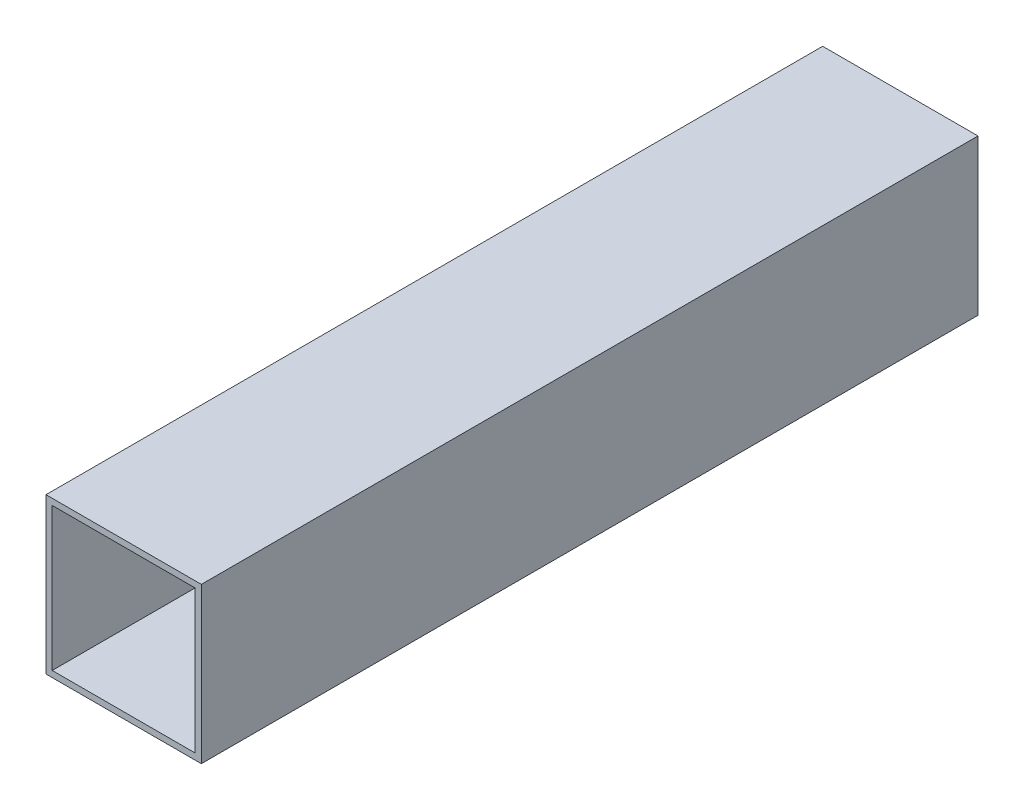
ISO-10303-21;
HEADER;
FILE_DESCRIPTION(('STEP AP214'),'2;1');
FILE_NAME('part.step','',(''),(''),'','','');
FILE_SCHEMA(('AUTOMOTIVE_DESIGN { 1 0 10303 214 1 1 1 1 }'));
ENDSEC;
DATA;
#1=APPLICATION_CONTEXT('core data for automotive mechanical design processes');
#2=APPLICATION_PROTOCOL_DEFINITION('international standard','automotive_design',2000,#1);
#3=PRODUCT_CONTEXT('',#1,'mechanical');
#4=PRODUCT('Part','Part','',(#3));
#5=PRODUCT_RELATED_PRODUCT_CATEGORY('part','',(#4));
#6=PRODUCT_DEFINITION_FORMATION('','',#4);
#7=PRODUCT_DEFINITION_CONTEXT('part definition',#1,'design');
#8=PRODUCT_DEFINITION('design','',#6,#7);
#9=PRODUCT_DEFINITION_SHAPE('','',#8);
#10=(LENGTH_UNIT() NAMED_UNIT(*) SI_UNIT(.MILLI.,.METRE.));
#11=(NAMED_UNIT(*) PLANE_ANGLE_UNIT() SI_UNIT($,.RADIAN.));
#12=(NAMED_UNIT(*) SI_UNIT($,.STERADIAN.) SOLID_ANGLE_UNIT());
#13=UNCERTAINTY_MEASURE_WITH_UNIT(LENGTH_MEASURE(1.E-05),#10,'distance_accuracy_value','');
#14=(GEOMETRIC_REPRESENTATION_CONTEXT(3) GLOBAL_UNCERTAINTY_ASSIGNED_CONTEXT((#13)) GLOBAL_UNIT_ASSIGNED_CONTEXT((#10,
#11,#12)) REPRESENTATION_CONTEXT('',''));
#15=CARTESIAN_POINT('',(0.,0.,0.));
#16=DIRECTION('',(0.,0.,1.));
#17=DIRECTION('',(1.,0.,0.));
#18=AXIS2_PLACEMENT_3D('',#15,#16,#17);
#19=CARTESIAN_POINT('',(0.,0.,200.));
#20=DIRECTION('',(0.,0.,-1.));
#21=DIRECTION('',(-1.,0.,0.));
#22=AXIS2_PLACEMENT_3D('',#19,#20,#21);
#23=PLANE('',#22);
#24=DIRECTION('',(0.,1.,0.));
#25=VECTOR('',#24,1.);
#26=CARTESIAN_POINT('',(20.,-20.,200.));
#27=LINE('',#26,#25);
#28=CARTESIAN_POINT('',(20.,-20.,200.));
#29=VERTEX_POINT('',#28);
#30=CARTESIAN_POINT('',(20.,20.,200.));
#31=VERTEX_POINT('',#30);
#32=EDGE_CURVE('E135',#29,#31,#27,.T.);
#33=ORIENTED_EDGE('',*,*,#32,.T.);
#34=DIRECTION('',(-1.,0.,0.));
#35=VECTOR('',#34,1.);
#36=CARTESIAN_POINT('',(-20.,20.,200.));
#37=LINE('',#36,#35);
#38=CARTESIAN_POINT('',(-20.,20.,200.));
#39=VERTEX_POINT('',#38);
#40=EDGE_CURVE('E138',#31,#39,#37,.T.);
#41=ORIENTED_EDGE('',*,*,#40,.T.);
#42=DIRECTION('',(0.,-1.,0.));
#43=VECTOR('',#42,1.);
#44=CARTESIAN_POINT('',(-20.,-20.,200.));
#45=LINE('',#44,#43);
#46=CARTESIAN_POINT('',(-20.,-20.,200.));
#47=VERTEX_POINT('',#46);
#48=EDGE_CURVE('E141',#39,#47,#45,.T.);
#49=ORIENTED_EDGE('',*,*,#48,.T.);
#50=DIRECTION('',(1.,0.,0.));
#51=VECTOR('',#50,1.);
#52=CARTESIAN_POINT('',(-20.,-20.,200.));
#53=LINE('',#52,#51);
#54=EDGE_CURVE('E143',#47,#29,#53,.T.);
#55=ORIENTED_EDGE('',*,*,#54,.T.);
#56=EDGE_LOOP('',(#33,#41,#49,#55));
#57=FACE_BOUND('',#56,.T.);
#58=DIRECTION('',(0.,1.,0.));
#59=VECTOR('',#58,1.);
#60=CARTESIAN_POINT('',(18.4,-18.4,200.));
#61=LINE('',#60,#59);
#62=CARTESIAN_POINT('',(18.4,-18.4,200.));
#63=VERTEX_POINT('',#62);
#64=CARTESIAN_POINT('',(18.4,18.4,200.));
#65=VERTEX_POINT('',#64);
#66=EDGE_CURVE('E99',#63,#65,#61,.T.);
#67=ORIENTED_EDGE('',*,*,#66,.F.);
#68=DIRECTION('',(1.,0.,0.));
#69=VECTOR('',#68,1.);
#70=CARTESIAN_POINT('',(-18.4,-18.4,200.));
#71=LINE('',#70,#69);
#72=CARTESIAN_POINT('',(-18.4,-18.4,200.));
#73=VERTEX_POINT('',#72);
#74=EDGE_CURVE('E121',#73,#63,#71,.T.);
#75=ORIENTED_EDGE('',*,*,#74,.F.);
#76=DIRECTION('',(0.,-1.,0.));
#77=VECTOR('',#76,1.);
#78=CARTESIAN_POINT('',(-18.4,-18.4,200.));
#79=LINE('',#78,#77);
#80=CARTESIAN_POINT('',(-18.4,18.4,200.));
#81=VERTEX_POINT('',#80);
#82=EDGE_CURVE('E119',#81,#73,#79,.T.);
#83=ORIENTED_EDGE('',*,*,#82,.F.);
#84=DIRECTION('',(-1.,0.,0.));
#85=VECTOR('',#84,1.);
#86=CARTESIAN_POINT('',(-18.4,18.4,200.));
#87=LINE('',#86,#85);
#88=EDGE_CURVE('E107',#65,#81,#87,.T.);
#89=ORIENTED_EDGE('',*,*,#88,.F.);
#90=EDGE_LOOP('',(#67,#75,#83,#89));
#91=FACE_BOUND('',#90,.T.);
#92=ADVANCED_FACE('F34',(#57,#91),#23,.F.);
#93=CARTESIAN_POINT('',(0.,0.,0.));
#94=DIRECTION('',(0.,0.,-1.));
#95=DIRECTION('',(-1.,0.,0.));
#96=AXIS2_PLACEMENT_3D('',#93,#94,#95);
#97=PLANE('',#96);
#98=DIRECTION('',(0.,1.,0.));
#99=VECTOR('',#98,1.);
#100=CARTESIAN_POINT('',(20.,-20.,0.));
#101=LINE('',#100,#99);
#102=CARTESIAN_POINT('',(20.,-20.,0.));
#103=VERTEX_POINT('',#102);
#104=CARTESIAN_POINT('',(20.,20.,0.));
#105=VERTEX_POINT('',#104);
#106=EDGE_CURVE('E115',#103,#105,#101,.T.);
#107=ORIENTED_EDGE('',*,*,#106,.F.);
#108=DIRECTION('',(1.,0.,0.));
#109=VECTOR('',#108,1.);
#110=CARTESIAN_POINT('',(-20.,-20.,0.));
#111=LINE('',#110,#109);
#112=CARTESIAN_POINT('',(-20.,-20.,0.));
#113=VERTEX_POINT('',#112);
#114=EDGE_CURVE('E139',#113,#103,#111,.T.);
#115=ORIENTED_EDGE('',*,*,#114,.F.);
#116=DIRECTION('',(0.,-1.,0.));
#117=VECTOR('',#116,1.);
#118=CARTESIAN_POINT('',(-20.,-20.,0.));
#119=LINE('',#118,#117);
#120=CARTESIAN_POINT('',(-20.,20.,0.));
#121=VERTEX_POINT('',#120);
#122=EDGE_CURVE('E150',#121,#113,#119,.T.);
#123=ORIENTED_EDGE('',*,*,#122,.F.);
#124=DIRECTION('',(-1.,0.,0.));
#125=VECTOR('',#124,1.);
#126=CARTESIAN_POINT('',(-20.,20.,0.));
#127=LINE('',#126,#125);
#128=EDGE_CURVE('E148',#105,#121,#127,.T.);
#129=ORIENTED_EDGE('',*,*,#128,.F.);
#130=EDGE_LOOP('',(#107,#115,#123,#129));
#131=FACE_BOUND('',#130,.T.);
#132=DIRECTION('',(1.,0.,0.));
#133=VECTOR('',#132,1.);
#134=CARTESIAN_POINT('',(-18.4,-18.4,0.));
#135=LINE('',#134,#133);
#136=CARTESIAN_POINT('',(-18.4,-18.4,0.));
#137=VERTEX_POINT('',#136);
#138=CARTESIAN_POINT('',(18.4,-18.4,0.));
#139=VERTEX_POINT('',#138);
#140=EDGE_CURVE('E108',#137,#139,#135,.T.);
#141=ORIENTED_EDGE('',*,*,#140,.T.);
#142=DIRECTION('',(0.,1.,0.));
#143=VECTOR('',#142,1.);
#144=CARTESIAN_POINT('',(18.4,-18.4,0.));
#145=LINE('',#144,#143);
#146=CARTESIAN_POINT('',(18.4,18.4,0.));
#147=VERTEX_POINT('',#146);
#148=EDGE_CURVE('E57',#139,#147,#145,.T.);
#149=ORIENTED_EDGE('',*,*,#148,.T.);
#150=DIRECTION('',(-1.,0.,0.));
#151=VECTOR('',#150,1.);
#152=CARTESIAN_POINT('',(-18.4,18.4,0.));
#153=LINE('',#152,#151);
#154=CARTESIAN_POINT('',(-18.4,18.4,0.));
#155=VERTEX_POINT('',#154);
#156=EDGE_CURVE('E114',#147,#155,#153,.T.);
#157=ORIENTED_EDGE('',*,*,#156,.T.);
#158=DIRECTION('',(0.,-1.,0.));
#159=VECTOR('',#158,1.);
#160=CARTESIAN_POINT('',(-18.4,-18.4,0.));
#161=LINE('',#160,#159);
#162=EDGE_CURVE('E127',#155,#137,#161,.T.);
#163=ORIENTED_EDGE('',*,*,#162,.T.);
#164=EDGE_LOOP('',(#141,#149,#157,#163));
#165=FACE_BOUND('',#164,.T.);
#166=ADVANCED_FACE('F168',(#131,#165),#97,.T.);
#167=CARTESIAN_POINT('',(20.,-20.,200.));
#168=DIRECTION('',(-1.,0.,0.));
#169=DIRECTION('',(0.,0.,1.));
#170=AXIS2_PLACEMENT_3D('',#167,#168,#169);
#171=PLANE('',#170);
#172=ORIENTED_EDGE('',*,*,#106,.T.);
#173=DIRECTION('',(0.,0.,-1.));
#174=VECTOR('',#173,1.);
#175=CARTESIAN_POINT('',(20.,20.,200.));
#176=LINE('',#175,#174);
#177=EDGE_CURVE('E11',#31,#105,#176,.T.);
#178=ORIENTED_EDGE('',*,*,#177,.F.);
#179=ORIENTED_EDGE('',*,*,#32,.F.);
#180=DIRECTION('',(0.,0.,-1.));
#181=VECTOR('',#180,1.);
#182=CARTESIAN_POINT('',(20.,-20.,200.));
#183=LINE('',#182,#181);
#184=EDGE_CURVE('E145',#29,#103,#183,.T.);
#185=ORIENTED_EDGE('',*,*,#184,.T.);
#186=EDGE_LOOP('',(#172,#178,#179,#185));
#187=FACE_BOUND('',#186,.T.);
#188=ADVANCED_FACE('F36',(#187),#171,.F.);
#189=CARTESIAN_POINT('',(-20.,20.,200.));
#190=DIRECTION('',(0.,-1.,0.));
#191=DIRECTION('',(0.,0.,-1.));
#192=AXIS2_PLACEMENT_3D('',#189,#190,#191);
#193=PLANE('',#192);
#194=ORIENTED_EDGE('',*,*,#128,.T.);
#195=DIRECTION('',(0.,0.,-1.));
#196=VECTOR('',#195,1.);
#197=CARTESIAN_POINT('',(-20.,20.,200.));
#198=LINE('',#197,#196);
#199=EDGE_CURVE('E42',#39,#121,#198,.T.);
#200=ORIENTED_EDGE('',*,*,#199,.F.);
#201=ORIENTED_EDGE('',*,*,#40,.F.);
#202=ORIENTED_EDGE('',*,*,#177,.T.);
#203=EDGE_LOOP('',(#194,#200,#201,#202));
#204=FACE_BOUND('',#203,.T.);
#205=ADVANCED_FACE('F178',(#204),#193,.F.);
#206=CARTESIAN_POINT('',(-20.,-20.,200.));
#207=DIRECTION('',(1.,0.,0.));
#208=DIRECTION('',(0.,1.,0.));
#209=AXIS2_PLACEMENT_3D('',#206,#207,#208);
#210=PLANE('',#209);
#211=ORIENTED_EDGE('',*,*,#122,.T.);
#212=DIRECTION('',(0.,0.,-1.));
#213=VECTOR('',#212,1.);
#214=CARTESIAN_POINT('',(-20.,-20.,200.));
#215=LINE('',#214,#213);
#216=EDGE_CURVE('E155',#47,#113,#215,.T.);
#217=ORIENTED_EDGE('',*,*,#216,.F.);
#218=ORIENTED_EDGE('',*,*,#48,.F.);
#219=ORIENTED_EDGE('',*,*,#199,.T.);
#220=EDGE_LOOP('',(#211,#217,#218,#219));
#221=FACE_BOUND('',#220,.T.);
#222=ADVANCED_FACE('F162',(#221),#210,.F.);
#223=CARTESIAN_POINT('',(-20.,-20.,200.));
#224=DIRECTION('',(0.,1.,0.));
#225=DIRECTION('',(0.,0.,1.));
#226=AXIS2_PLACEMENT_3D('',#223,#224,#225);
#227=PLANE('',#226);
#228=ORIENTED_EDGE('',*,*,#114,.T.);
#229=ORIENTED_EDGE('',*,*,#184,.F.);
#230=ORIENTED_EDGE('',*,*,#54,.F.);
#231=ORIENTED_EDGE('',*,*,#216,.T.);
#232=EDGE_LOOP('',(#228,#229,#230,#231));
#233=FACE_BOUND('',#232,.T.);
#234=ADVANCED_FACE('F172',(#233),#227,.F.);
#235=CARTESIAN_POINT('',(18.4,-18.4,200.));
#236=DIRECTION('',(-1.,0.,0.));
#237=DIRECTION('',(0.,0.,1.));
#238=AXIS2_PLACEMENT_3D('',#235,#236,#237);
#239=PLANE('',#238);
#240=ORIENTED_EDGE('',*,*,#148,.F.);
#241=DIRECTION('',(0.,0.,-1.));
#242=VECTOR('',#241,1.);
#243=CARTESIAN_POINT('',(18.4,-18.4,200.));
#244=LINE('',#243,#242);
#245=EDGE_CURVE('E103',#63,#139,#244,.T.);
#246=ORIENTED_EDGE('',*,*,#245,.F.);
#247=ORIENTED_EDGE('',*,*,#66,.T.);
#248=DIRECTION('',(0.,0.,-1.));
#249=VECTOR('',#248,1.);
#250=CARTESIAN_POINT('',(18.4,18.4,200.));
#251=LINE('',#250,#249);
#252=EDGE_CURVE('E102',#65,#147,#251,.T.);
#253=ORIENTED_EDGE('',*,*,#252,.T.);
#254=EDGE_LOOP('',(#240,#246,#247,#253));
#255=FACE_BOUND('',#254,.T.);
#256=ADVANCED_FACE('F101',(#255),#239,.T.);
#257=CARTESIAN_POINT('',(-18.4,18.4,200.));
#258=DIRECTION('',(0.,-1.,0.));
#259=DIRECTION('',(0.,0.,-1.));
#260=AXIS2_PLACEMENT_3D('',#257,#258,#259);
#261=PLANE('',#260);
#262=ORIENTED_EDGE('',*,*,#156,.F.);
#263=ORIENTED_EDGE('',*,*,#252,.F.);
#264=ORIENTED_EDGE('',*,*,#88,.T.);
#265=DIRECTION('',(0.,0.,-1.));
#266=VECTOR('',#265,1.);
#267=CARTESIAN_POINT('',(-18.4,18.4,200.));
#268=LINE('',#267,#266);
#269=EDGE_CURVE('E116',#81,#155,#268,.T.);
#270=ORIENTED_EDGE('',*,*,#269,.T.);
#271=EDGE_LOOP('',(#262,#263,#264,#270));
#272=FACE_BOUND('',#271,.T.);
#273=ADVANCED_FACE('F111',(#272),#261,.T.);
#274=CARTESIAN_POINT('',(-18.4,-18.4,200.));
#275=DIRECTION('',(1.,0.,0.));
#276=DIRECTION('',(0.,0.,-1.));
#277=AXIS2_PLACEMENT_3D('',#274,#275,#276);
#278=PLANE('',#277);
#279=ORIENTED_EDGE('',*,*,#162,.F.);
#280=ORIENTED_EDGE('',*,*,#269,.F.);
#281=ORIENTED_EDGE('',*,*,#82,.T.);
#282=DIRECTION('',(0.,0.,-1.));
#283=VECTOR('',#282,1.);
#284=CARTESIAN_POINT('',(-18.4,-18.4,200.));
#285=LINE('',#284,#283);
#286=EDGE_CURVE('E49',#73,#137,#285,.T.);
#287=ORIENTED_EDGE('',*,*,#286,.T.);
#288=EDGE_LOOP('',(#279,#280,#281,#287));
#289=FACE_BOUND('',#288,.T.);
#290=ADVANCED_FACE('F201',(#289),#278,.T.);
#291=CARTESIAN_POINT('',(-18.4,-18.4,200.));
#292=DIRECTION('',(0.,1.,0.));
#293=DIRECTION('',(0.,0.,1.));
#294=AXIS2_PLACEMENT_3D('',#291,#292,#293);
#295=PLANE('',#294);
#296=ORIENTED_EDGE('',*,*,#140,.F.);
#297=ORIENTED_EDGE('',*,*,#286,.F.);
#298=ORIENTED_EDGE('',*,*,#74,.T.);
#299=ORIENTED_EDGE('',*,*,#245,.T.);
#300=EDGE_LOOP('',(#296,#297,#298,#299));
#301=FACE_BOUND('',#300,.T.);
#302=ADVANCED_FACE('F205',(#301),#295,.T.);
#303=CLOSED_SHELL('',(#92,#166,#188,#205,#222,#234,#256,#273,#290,#302));
#304=MANIFOLD_SOLID_BREP('B2',#303);
#305=ADVANCED_BREP_SHAPE_REPRESENTATION('',(#18,#304),#14);
#306=SHAPE_DEFINITION_REPRESENTATION(#9,#305);
ENDSEC;
END-ISO-10303-21;
